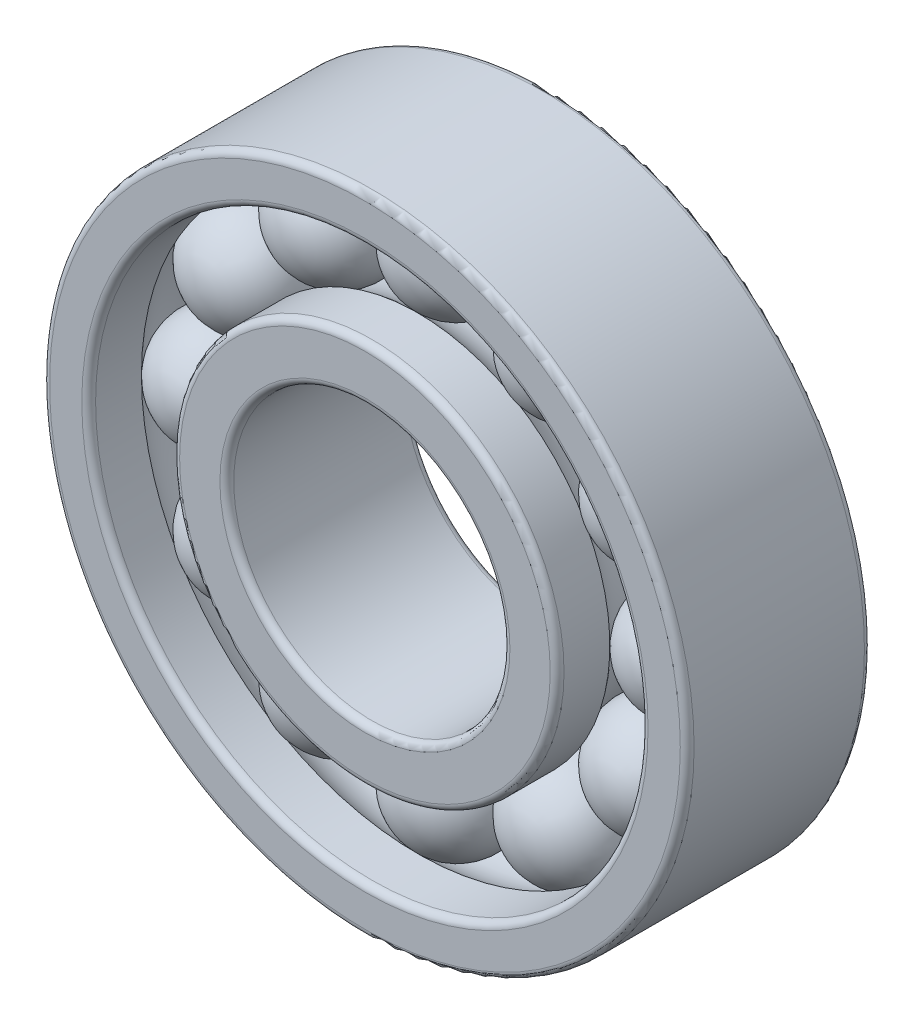
ISO-10303-21;
HEADER;
FILE_DESCRIPTION(('STEP AP214'),'2;1');
FILE_NAME('part.step','',(''),(''),'','','');
FILE_SCHEMA(('AUTOMOTIVE_DESIGN { 1 0 10303 214 1 1 1 1 }'));
ENDSEC;
DATA;
#1=APPLICATION_CONTEXT('core data for automotive mechanical design processes');
#2=APPLICATION_PROTOCOL_DEFINITION('international standard','automotive_design',2000,#1);
#3=PRODUCT_CONTEXT('',#1,'mechanical');
#4=PRODUCT('Part','Part','',(#3));
#5=PRODUCT_RELATED_PRODUCT_CATEGORY('part','',(#4));
#6=PRODUCT_DEFINITION_FORMATION('','',#4);
#7=PRODUCT_DEFINITION_CONTEXT('part definition',#1,'design');
#8=PRODUCT_DEFINITION('design','',#6,#7);
#9=PRODUCT_DEFINITION_SHAPE('','',#8);
#10=(LENGTH_UNIT() NAMED_UNIT(*) SI_UNIT(.MILLI.,.METRE.));
#11=(NAMED_UNIT(*) PLANE_ANGLE_UNIT() SI_UNIT($,.RADIAN.));
#12=(NAMED_UNIT(*) SI_UNIT($,.STERADIAN.) SOLID_ANGLE_UNIT());
#13=UNCERTAINTY_MEASURE_WITH_UNIT(LENGTH_MEASURE(1.E-05),#10,'distance_accuracy_value','');
#14=(GEOMETRIC_REPRESENTATION_CONTEXT(3) GLOBAL_UNCERTAINTY_ASSIGNED_CONTEXT((#13)) GLOBAL_UNIT_ASSIGNED_CONTEXT((#10,
#11,#12)) REPRESENTATION_CONTEXT('',''));
#15=CARTESIAN_POINT('',(0.,0.,0.));
#16=DIRECTION('',(0.,0.,1.));
#17=DIRECTION('',(1.,0.,0.));
#18=AXIS2_PLACEMENT_3D('',#15,#16,#17);
#19=CARTESIAN_POINT('',(-8.81180848350673,5.08749999999989,4.));
#20=DIRECTION('',(0.,0.,-1.));
#21=DIRECTION('',(0.866025403784445,-0.499999999999989,0.));
#22=AXIS2_PLACEMENT_3D('',#19,#20,#21);
#23=SPHERICAL_SURFACE('',#22,2.5);
#24=CARTESIAN_POINT('',(-8.81180848350673,5.08749999999989,1.5));
#25=VERTEX_POINT('',#24);
#26=VERTEX_LOOP('',#25);
#27=FACE_BOUND('',#26,.T.);
#28=ADVANCED_FACE('F73',(#27),#23,.T.);
#29=CLOSED_SHELL('',(#28));
#30=MANIFOLD_SOLID_BREP('B2',#29);
#31=CARTESIAN_POINT('',(-5.0875000000001,8.8118084835066,4.));
#32=DIRECTION('',(0.,0.,-1.));
#33=DIRECTION('',(0.50000000000001,-0.866025403784433,0.));
#34=AXIS2_PLACEMENT_3D('',#31,#32,#33);
#35=SPHERICAL_SURFACE('',#34,2.5);
#36=CARTESIAN_POINT('',(-5.0875000000001,8.8118084835066,1.5));
#37=VERTEX_POINT('',#36);
#38=VERTEX_LOOP('',#37);
#39=FACE_BOUND('',#38,.T.);
#40=ADVANCED_FACE('F91',(#39),#35,.T.);
#41=CLOSED_SHELL('',(#40));
#42=MANIFOLD_SOLID_BREP('B7',#41);
#43=CARTESIAN_POINT('',(-1.06577529597864E-13,10.175,4.));
#44=DIRECTION('',(0.,0.,-1.));
#45=DIRECTION('',(0.,-1.,0.));
#46=AXIS2_PLACEMENT_3D('',#43,#44,#45);
#47=SPHERICAL_SURFACE('',#46,2.5);
#48=CARTESIAN_POINT('',(-1.06577529597864E-13,10.175,1.5));
#49=VERTEX_POINT('',#48);
#50=VERTEX_LOOP('',#49);
#51=FACE_BOUND('',#50,.T.);
#52=ADVANCED_FACE('F109',(#51),#47,.T.);
#53=CLOSED_SHELL('',(#52));
#54=MANIFOLD_SOLID_BREP('B69',#53);
#55=CARTESIAN_POINT('',(5.08749999999992,8.81180848350671,4.));
#56=DIRECTION('',(0.,0.,-1.));
#57=DIRECTION('',(-0.499999999999992,-0.866025403784443,0.));
#58=AXIS2_PLACEMENT_3D('',#55,#56,#57);
#59=SPHERICAL_SURFACE('',#58,2.5);
#60=CARTESIAN_POINT('',(5.08749999999992,8.81180848350671,1.5));
#61=VERTEX_POINT('',#60);
#62=VERTEX_LOOP('',#61);
#63=FACE_BOUND('',#62,.T.);
#64=ADVANCED_FACE('F127',(#63),#59,.T.);
#65=CLOSED_SHELL('',(#64));
#66=MANIFOLD_SOLID_BREP('B87',#65);
#67=CARTESIAN_POINT('',(8.81180848350662,5.08750000000007,4.));
#68=DIRECTION('',(0.,0.,-1.));
#69=DIRECTION('',(-0.866025403784435,-0.500000000000007,0.));
#70=AXIS2_PLACEMENT_3D('',#67,#68,#69);
#71=SPHERICAL_SURFACE('',#70,2.5);
#72=CARTESIAN_POINT('',(8.81180848350662,5.08750000000007,1.5));
#73=VERTEX_POINT('',#72);
#74=VERTEX_LOOP('',#73);
#75=FACE_BOUND('',#74,.T.);
#76=ADVANCED_FACE('F145',(#75),#71,.T.);
#77=CLOSED_SHELL('',(#76));
#78=MANIFOLD_SOLID_BREP('B105',#77);
#79=CARTESIAN_POINT('',(10.175,0.,4.));
#80=DIRECTION('',(0.,0.,-1.));
#81=DIRECTION('',(-1.,0.,0.));
#82=AXIS2_PLACEMENT_3D('',#79,#80,#81);
#83=SPHERICAL_SURFACE('',#82,2.5);
#84=CARTESIAN_POINT('',(10.175,0.,1.5));
#85=VERTEX_POINT('',#84);
#86=VERTEX_LOOP('',#85);
#87=FACE_BOUND('',#86,.T.);
#88=ADVANCED_FACE('F163',(#87),#83,.T.);
#89=CLOSED_SHELL('',(#88));
#90=MANIFOLD_SOLID_BREP('B123',#89);
#91=CARTESIAN_POINT('',(8.81180848350669,-5.08749999999995,4.));
#92=DIRECTION('',(0.,0.,-1.));
#93=DIRECTION('',(-0.866025403784442,0.499999999999995,0.));
#94=AXIS2_PLACEMENT_3D('',#91,#92,#93);
#95=SPHERICAL_SURFACE('',#94,2.5);
#96=CARTESIAN_POINT('',(8.81180848350669,-5.08749999999995,1.5));
#97=VERTEX_POINT('',#96);
#98=VERTEX_LOOP('',#97);
#99=FACE_BOUND('',#98,.T.);
#100=ADVANCED_FACE('F181',(#99),#95,.T.);
#101=CLOSED_SHELL('',(#100));
#102=MANIFOLD_SOLID_BREP('B141',#101);
#103=CARTESIAN_POINT('',(5.08750000000004,-8.81180848350664,4.));
#104=DIRECTION('',(0.,0.,-1.));
#105=DIRECTION('',(-0.500000000000004,0.866025403784436,0.));
#106=AXIS2_PLACEMENT_3D('',#103,#104,#105);
#107=SPHERICAL_SURFACE('',#106,2.5);
#108=CARTESIAN_POINT('',(5.08750000000004,-8.81180848350664,1.5));
#109=VERTEX_POINT('',#108);
#110=VERTEX_LOOP('',#109);
#111=FACE_BOUND('',#110,.T.);
#112=ADVANCED_FACE('F199',(#111),#107,.T.);
#113=CLOSED_SHELL('',(#112));
#114=MANIFOLD_SOLID_BREP('B159',#113);
#115=CARTESIAN_POINT('',(0.,-10.175,4.));
#116=DIRECTION('',(0.,0.,-1.));
#117=DIRECTION('',(0.,1.,0.));
#118=AXIS2_PLACEMENT_3D('',#115,#116,#117);
#119=SPHERICAL_SURFACE('',#118,2.5);
#120=CARTESIAN_POINT('',(0.,-10.175,1.5));
#121=VERTEX_POINT('',#120);
#122=VERTEX_LOOP('',#121);
#123=FACE_BOUND('',#122,.T.);
#124=ADVANCED_FACE('F217',(#123),#119,.T.);
#125=CLOSED_SHELL('',(#124));
#126=MANIFOLD_SOLID_BREP('B177',#125);
#127=CARTESIAN_POINT('',(-5.08749999999998,-8.81180848350667,4.));
#128=DIRECTION('',(0.,0.,-1.));
#129=DIRECTION('',(0.499999999999998,0.86602540378444,0.));
#130=AXIS2_PLACEMENT_3D('',#127,#128,#129);
#131=SPHERICAL_SURFACE('',#130,2.5);
#132=CARTESIAN_POINT('',(-5.08749999999998,-8.81180848350667,1.5));
#133=VERTEX_POINT('',#132);
#134=VERTEX_LOOP('',#133);
#135=FACE_BOUND('',#134,.T.);
#136=ADVANCED_FACE('F235',(#135),#131,.T.);
#137=CLOSED_SHELL('',(#136));
#138=MANIFOLD_SOLID_BREP('B195',#137);
#139=CARTESIAN_POINT('',(-8.81180848350666,-5.08750000000001,4.));
#140=DIRECTION('',(0.,0.,-1.));
#141=DIRECTION('',(0.866025403784438,0.500000000000001,0.));
#142=AXIS2_PLACEMENT_3D('',#139,#140,#141);
#143=SPHERICAL_SURFACE('',#142,2.5);
#144=CARTESIAN_POINT('',(-8.81180848350666,-5.08750000000001,1.5));
#145=VERTEX_POINT('',#144);
#146=VERTEX_LOOP('',#145);
#147=FACE_BOUND('',#146,.T.);
#148=ADVANCED_FACE('F253',(#147),#143,.T.);
#149=CLOSED_SHELL('',(#148));
#150=MANIFOLD_SOLID_BREP('B213',#149);
#151=CARTESIAN_POINT('',(-10.175,0.,4.));
#152=DIRECTION('',(0.,0.,-1.));
#153=DIRECTION('',(1.,0.,0.));
#154=AXIS2_PLACEMENT_3D('',#151,#152,#153);
#155=SPHERICAL_SURFACE('',#154,2.5);
#156=CARTESIAN_POINT('',(-10.175,0.,1.5));
#157=VERTEX_POINT('',#156);
#158=VERTEX_LOOP('',#157);
#159=FACE_BOUND('',#158,.T.);
#160=ADVANCED_FACE('F273',(#159),#155,.T.);
#161=CLOSED_SHELL('',(#160));
#162=MANIFOLD_SOLID_BREP('B231',#161);
#163=CARTESIAN_POINT('',(0.,0.,8.));
#164=DIRECTION('',(0.,0.,-1.));
#165=DIRECTION('',(-1.,0.,0.));
#166=AXIS2_PLACEMENT_3D('',#163,#164,#165);
#167=CYLINDRICAL_SURFACE('',#166,8.35);
#168=CARTESIAN_POINT('',(0.,0.,0.3));
#169=DIRECTION('',(0.,0.,1.));
#170=DIRECTION('',(1.,0.,0.));
#171=AXIS2_PLACEMENT_3D('',#168,#169,#170);
#172=CIRCLE('',#171,8.35);
#173=CARTESIAN_POINT('',(8.35,0.,0.3));
#174=VERTEX_POINT('',#173);
#175=EDGE_CURVE('E272',#174,#174,#172,.T.);
#176=ORIENTED_EDGE('',*,*,#175,.T.);
#177=EDGE_LOOP('',(#176));
#178=FACE_BOUND('',#177,.T.);
#179=CARTESIAN_POINT('',(0.,0.,2.29138213751582));
#180=DIRECTION('',(0.,0.,1.));
#181=DIRECTION('',(1.,0.,0.));
#182=AXIS2_PLACEMENT_3D('',#179,#180,#181);
#183=CIRCLE('',#182,8.35);
#184=CARTESIAN_POINT('',(8.35,0.,2.29138213751582));
#185=VERTEX_POINT('',#184);
#186=EDGE_CURVE('E324',#185,#185,#183,.F.);
#187=ORIENTED_EDGE('',*,*,#186,.T.);
#188=EDGE_LOOP('',(#187));
#189=FACE_BOUND('',#188,.T.);
#190=ADVANCED_FACE('F292',(#178,#189),#167,.T.);
#191=CARTESIAN_POINT('',(0.,0.,8.));
#192=DIRECTION('',(0.,0.,1.));
#193=DIRECTION('',(1.,0.,0.));
#194=AXIS2_PLACEMENT_3D('',#191,#192,#193);
#195=PLANE('',#194);
#196=CARTESIAN_POINT('',(0.,0.,8.));
#197=DIRECTION('',(0.,0.,1.));
#198=DIRECTION('',(1.,0.,0.));
#199=AXIS2_PLACEMENT_3D('',#196,#197,#198);
#200=CIRCLE('',#199,6.3);
#201=CARTESIAN_POINT('',(6.3,0.,8.));
#202=VERTEX_POINT('',#201);
#203=EDGE_CURVE('E312',#202,#202,#200,.F.);
#204=ORIENTED_EDGE('',*,*,#203,.T.);
#205=EDGE_LOOP('',(#204));
#206=FACE_BOUND('',#205,.T.);
#207=CARTESIAN_POINT('',(0.,0.,8.));
#208=DIRECTION('',(0.,0.,1.));
#209=DIRECTION('',(1.,0.,0.));
#210=AXIS2_PLACEMENT_3D('',#207,#208,#209);
#211=CIRCLE('',#210,8.05);
#212=CARTESIAN_POINT('',(8.05,0.,8.));
#213=VERTEX_POINT('',#212);
#214=EDGE_CURVE('E315',#213,#213,#211,.T.);
#215=ORIENTED_EDGE('',*,*,#214,.T.);
#216=EDGE_LOOP('',(#215));
#217=FACE_BOUND('',#216,.T.);
#218=ADVANCED_FACE('F351',(#206,#217),#195,.T.);
#219=CARTESIAN_POINT('',(0.,0.,0.));
#220=DIRECTION('',(0.,0.,1.));
#221=DIRECTION('',(1.,0.,0.));
#222=AXIS2_PLACEMENT_3D('',#219,#220,#221);
#223=PLANE('',#222);
#224=CARTESIAN_POINT('',(0.,0.,0.));
#225=DIRECTION('',(0.,0.,1.));
#226=DIRECTION('',(1.,0.,0.));
#227=AXIS2_PLACEMENT_3D('',#224,#225,#226);
#228=CIRCLE('',#227,6.3);
#229=CARTESIAN_POINT('',(6.3,0.,0.));
#230=VERTEX_POINT('',#229);
#231=EDGE_CURVE('E299',#230,#230,#228,.T.);
#232=ORIENTED_EDGE('',*,*,#231,.T.);
#233=EDGE_LOOP('',(#232));
#234=FACE_BOUND('',#233,.T.);
#235=CARTESIAN_POINT('',(0.,0.,0.));
#236=DIRECTION('',(0.,0.,1.));
#237=DIRECTION('',(1.,0.,0.));
#238=AXIS2_PLACEMENT_3D('',#235,#236,#237);
#239=CIRCLE('',#238,8.05);
#240=CARTESIAN_POINT('',(8.05,0.,0.));
#241=VERTEX_POINT('',#240);
#242=EDGE_CURVE('E303',#241,#241,#239,.F.);
#243=ORIENTED_EDGE('',*,*,#242,.T.);
#244=EDGE_LOOP('',(#243));
#245=FACE_BOUND('',#244,.T.);
#246=ADVANCED_FACE('F355',(#234,#245),#223,.F.);
#247=CARTESIAN_POINT('',(0.,0.,7.7));
#248=DIRECTION('',(0.,0.,1.));
#249=DIRECTION('',(1.,0.,0.));
#250=AXIS2_PLACEMENT_3D('',#247,#248,#249);
#251=CIRCLE('',#250,8.35);
#252=CARTESIAN_POINT('',(8.35,0.,7.7));
#253=VERTEX_POINT('',#252);
#254=EDGE_CURVE('E307',#253,#253,#251,.F.);
#255=ORIENTED_EDGE('',*,*,#254,.T.);
#256=EDGE_LOOP('',(#255));
#257=FACE_BOUND('',#256,.T.);
#258=CARTESIAN_POINT('',(0.,0.,5.70861786248418));
#259=DIRECTION('',(0.,0.,-1.));
#260=DIRECTION('',(-1.,0.,0.));
#261=AXIS2_PLACEMENT_3D('',#258,#259,#260);
#262=CIRCLE('',#261,8.35);
#263=CARTESIAN_POINT('',(-8.35,0.,5.70861786248418));
#264=VERTEX_POINT('',#263);
#265=EDGE_CURVE('E327',#264,#264,#262,.F.);
#266=ORIENTED_EDGE('',*,*,#265,.T.);
#267=EDGE_LOOP('',(#266));
#268=FACE_BOUND('',#267,.T.);
#269=ADVANCED_FACE('F331',(#257,#268),#167,.T.);
#270=CARTESIAN_POINT('',(0.,0.,8.));
#271=DIRECTION('',(0.,0.,-1.));
#272=DIRECTION('',(-1.,0.,0.));
#273=AXIS2_PLACEMENT_3D('',#270,#271,#272);
#274=CYLINDRICAL_SURFACE('',#273,6.);
#275=CARTESIAN_POINT('',(0.,0.,7.7));
#276=DIRECTION('',(0.,0.,1.));
#277=DIRECTION('',(1.,0.,0.));
#278=AXIS2_PLACEMENT_3D('',#275,#276,#277);
#279=CIRCLE('',#278,6.);
#280=CARTESIAN_POINT('',(6.,0.,7.7));
#281=VERTEX_POINT('',#280);
#282=EDGE_CURVE('E318',#281,#281,#279,.T.);
#283=ORIENTED_EDGE('',*,*,#282,.T.);
#284=EDGE_LOOP('',(#283));
#285=FACE_BOUND('',#284,.T.);
#286=CARTESIAN_POINT('',(0.,0.,0.3));
#287=DIRECTION('',(0.,0.,1.));
#288=DIRECTION('',(1.,0.,0.));
#289=AXIS2_PLACEMENT_3D('',#286,#287,#288);
#290=CIRCLE('',#289,6.);
#291=CARTESIAN_POINT('',(6.,0.,0.3));
#292=VERTEX_POINT('',#291);
#293=EDGE_CURVE('E321',#292,#292,#290,.F.);
#294=ORIENTED_EDGE('',*,*,#293,.T.);
#295=EDGE_LOOP('',(#294));
#296=FACE_BOUND('',#295,.T.);
#297=ADVANCED_FACE('F336',(#285,#296),#274,.F.);
#298=CARTESIAN_POINT('',(0.,0.,4.));
#299=DIRECTION('',(0.,0.,-1.));
#300=DIRECTION('',(-1.,0.,0.));
#301=AXIS2_PLACEMENT_3D('',#298,#299,#300);
#302=TOROIDAL_SURFACE('',#301,10.175,2.5);
#303=ORIENTED_EDGE('',*,*,#186,.F.);
#304=EDGE_LOOP('',(#303));
#305=FACE_BOUND('',#304,.T.);
#306=ORIENTED_EDGE('',*,*,#265,.F.);
#307=EDGE_LOOP('',(#306));
#308=FACE_BOUND('',#307,.T.);
#309=ADVANCED_FACE('F333',(#305,#308),#302,.F.);
#310=CARTESIAN_POINT('',(0.,0.,7.7));
#311=DIRECTION('',(0.,0.,1.));
#312=DIRECTION('',(1.,0.,0.));
#313=AXIS2_PLACEMENT_3D('',#310,#311,#312);
#314=TOROIDAL_SURFACE('',#313,6.3,0.3);
#315=ORIENTED_EDGE('',*,*,#203,.F.);
#316=EDGE_LOOP('',(#315));
#317=FACE_BOUND('',#316,.T.);
#318=ORIENTED_EDGE('',*,*,#282,.F.);
#319=EDGE_LOOP('',(#318));
#320=FACE_BOUND('',#319,.T.);
#321=ADVANCED_FACE('F335',(#317,#320),#314,.T.);
#322=CARTESIAN_POINT('',(0.,0.,7.7));
#323=DIRECTION('',(0.,0.,1.));
#324=DIRECTION('',(1.,0.,0.));
#325=AXIS2_PLACEMENT_3D('',#322,#323,#324);
#326=TOROIDAL_SURFACE('',#325,8.05,0.3);
#327=ORIENTED_EDGE('',*,*,#254,.F.);
#328=EDGE_LOOP('',(#327));
#329=FACE_BOUND('',#328,.T.);
#330=ORIENTED_EDGE('',*,*,#214,.F.);
#331=EDGE_LOOP('',(#330));
#332=FACE_BOUND('',#331,.T.);
#333=ADVANCED_FACE('F343',(#329,#332),#326,.T.);
#334=CARTESIAN_POINT('',(0.,0.,0.3));
#335=DIRECTION('',(0.,0.,1.));
#336=DIRECTION('',(1.,0.,0.));
#337=AXIS2_PLACEMENT_3D('',#334,#335,#336);
#338=TOROIDAL_SURFACE('',#337,6.3,0.3);
#339=ORIENTED_EDGE('',*,*,#293,.F.);
#340=EDGE_LOOP('',(#339));
#341=FACE_BOUND('',#340,.T.);
#342=ORIENTED_EDGE('',*,*,#231,.F.);
#343=EDGE_LOOP('',(#342));
#344=FACE_BOUND('',#343,.T.);
#345=ADVANCED_FACE('F369',(#341,#344),#338,.T.);
#346=CARTESIAN_POINT('',(0.,0.,0.3));
#347=DIRECTION('',(0.,0.,1.));
#348=DIRECTION('',(1.,0.,0.));
#349=AXIS2_PLACEMENT_3D('',#346,#347,#348);
#350=TOROIDAL_SURFACE('',#349,8.05,0.3);
#351=ORIENTED_EDGE('',*,*,#242,.F.);
#352=EDGE_LOOP('',(#351));
#353=FACE_BOUND('',#352,.T.);
#354=ORIENTED_EDGE('',*,*,#175,.F.);
#355=EDGE_LOOP('',(#354));
#356=FACE_BOUND('',#355,.T.);
#357=ADVANCED_FACE('F294',(#353,#356),#350,.T.);
#358=CLOSED_SHELL('',(#190,#218,#246,#269,#297,#309,#321,#333,#345,#357));
#359=MANIFOLD_SOLID_BREP('B249',#358);
#360=CARTESIAN_POINT('',(0.,0.,8.));
#361=DIRECTION('',(0.,0.,-1.));
#362=DIRECTION('',(-1.,0.,0.));
#363=AXIS2_PLACEMENT_3D('',#360,#361,#362);
#364=CYLINDRICAL_SURFACE('',#363,12.);
#365=CARTESIAN_POINT('',(0.,0.,0.3));
#366=DIRECTION('',(0.,0.,1.));
#367=DIRECTION('',(1.,0.,0.));
#368=AXIS2_PLACEMENT_3D('',#365,#366,#367);
#369=CIRCLE('',#368,12.);
#370=CARTESIAN_POINT('',(12.,0.,0.3));
#371=VERTEX_POINT('',#370);
#372=EDGE_CURVE('E465',#371,#371,#369,.F.);
#373=ORIENTED_EDGE('',*,*,#372,.T.);
#374=EDGE_LOOP('',(#373));
#375=FACE_BOUND('',#374,.T.);
#376=CARTESIAN_POINT('',(0.,0.,2.29138213751582));
#377=DIRECTION('',(0.,0.,1.));
#378=DIRECTION('',(1.,0.,0.));
#379=AXIS2_PLACEMENT_3D('',#376,#377,#378);
#380=CIRCLE('',#379,12.);
#381=CARTESIAN_POINT('',(12.,0.,2.29138213751582));
#382=VERTEX_POINT('',#381);
#383=EDGE_CURVE('E474',#382,#382,#380,.F.);
#384=ORIENTED_EDGE('',*,*,#383,.F.);
#385=EDGE_LOOP('',(#384));
#386=FACE_BOUND('',#385,.T.);
#387=ADVANCED_FACE('F442',(#375,#386),#364,.F.);
#388=CARTESIAN_POINT('',(0.,0.,8.));
#389=DIRECTION('',(0.,0.,1.));
#390=DIRECTION('',(1.,0.,0.));
#391=AXIS2_PLACEMENT_3D('',#388,#389,#390);
#392=PLANE('',#391);
#393=CARTESIAN_POINT('',(0.,0.,8.));
#394=DIRECTION('',(0.,0.,1.));
#395=DIRECTION('',(1.,0.,0.));
#396=AXIS2_PLACEMENT_3D('',#393,#394,#395);
#397=CIRCLE('',#396,12.3);
#398=CARTESIAN_POINT('',(12.3,0.,8.));
#399=VERTEX_POINT('',#398);
#400=EDGE_CURVE('E291',#399,#399,#397,.F.);
#401=ORIENTED_EDGE('',*,*,#400,.T.);
#402=EDGE_LOOP('',(#401));
#403=FACE_BOUND('',#402,.T.);
#404=CARTESIAN_POINT('',(0.,0.,8.));
#405=DIRECTION('',(0.,0.,1.));
#406=DIRECTION('',(1.,0.,0.));
#407=AXIS2_PLACEMENT_3D('',#404,#405,#406);
#408=CIRCLE('',#407,13.7);
#409=CARTESIAN_POINT('',(13.7,0.,8.));
#410=VERTEX_POINT('',#409);
#411=EDGE_CURVE('E449',#410,#410,#408,.T.);
#412=ORIENTED_EDGE('',*,*,#411,.T.);
#413=EDGE_LOOP('',(#412));
#414=FACE_BOUND('',#413,.T.);
#415=ADVANCED_FACE('F500',(#403,#414),#392,.T.);
#416=CARTESIAN_POINT('',(0.,0.,0.));
#417=DIRECTION('',(0.,0.,1.));
#418=DIRECTION('',(1.,0.,0.));
#419=AXIS2_PLACEMENT_3D('',#416,#417,#418);
#420=PLANE('',#419);
#421=CARTESIAN_POINT('',(0.,0.,0.));
#422=DIRECTION('',(0.,0.,1.));
#423=DIRECTION('',(1.,0.,0.));
#424=AXIS2_PLACEMENT_3D('',#421,#422,#423);
#425=CIRCLE('',#424,12.3);
#426=CARTESIAN_POINT('',(12.3,0.,0.));
#427=VERTEX_POINT('',#426);
#428=EDGE_CURVE('E468',#427,#427,#425,.T.);
#429=ORIENTED_EDGE('',*,*,#428,.T.);
#430=EDGE_LOOP('',(#429));
#431=FACE_BOUND('',#430,.T.);
#432=CARTESIAN_POINT('',(0.,0.,0.));
#433=DIRECTION('',(0.,0.,1.));
#434=DIRECTION('',(1.,0.,0.));
#435=AXIS2_PLACEMENT_3D('',#432,#433,#434);
#436=CIRCLE('',#435,13.7);
#437=CARTESIAN_POINT('',(13.7,0.,0.));
#438=VERTEX_POINT('',#437);
#439=EDGE_CURVE('E471',#438,#438,#436,.F.);
#440=ORIENTED_EDGE('',*,*,#439,.T.);
#441=EDGE_LOOP('',(#440));
#442=FACE_BOUND('',#441,.T.);
#443=ADVANCED_FACE('F495',(#431,#442),#420,.F.);
#444=CARTESIAN_POINT('',(0.,0.,8.));
#445=DIRECTION('',(0.,0.,-1.));
#446=DIRECTION('',(-1.,0.,0.));
#447=AXIS2_PLACEMENT_3D('',#444,#445,#446);
#448=CYLINDRICAL_SURFACE('',#447,14.);
#449=CARTESIAN_POINT('',(0.,0.,0.3));
#450=DIRECTION('',(0.,0.,1.));
#451=DIRECTION('',(1.,0.,0.));
#452=AXIS2_PLACEMENT_3D('',#449,#450,#451);
#453=CIRCLE('',#452,14.);
#454=CARTESIAN_POINT('',(14.,0.,0.3));
#455=VERTEX_POINT('',#454);
#456=EDGE_CURVE('E457',#455,#455,#453,.T.);
#457=ORIENTED_EDGE('',*,*,#456,.T.);
#458=EDGE_LOOP('',(#457));
#459=FACE_BOUND('',#458,.T.);
#460=CARTESIAN_POINT('',(0.,0.,7.7));
#461=DIRECTION('',(0.,0.,1.));
#462=DIRECTION('',(1.,0.,0.));
#463=AXIS2_PLACEMENT_3D('',#460,#461,#462);
#464=CIRCLE('',#463,14.);
#465=CARTESIAN_POINT('',(14.,0.,7.7));
#466=VERTEX_POINT('',#465);
#467=EDGE_CURVE('E462',#466,#466,#464,.F.);
#468=ORIENTED_EDGE('',*,*,#467,.T.);
#469=EDGE_LOOP('',(#468));
#470=FACE_BOUND('',#469,.T.);
#471=ADVANCED_FACE('F486',(#459,#470),#448,.T.);
#472=CARTESIAN_POINT('',(0.,0.,7.7));
#473=DIRECTION('',(0.,0.,1.));
#474=DIRECTION('',(1.,0.,0.));
#475=AXIS2_PLACEMENT_3D('',#472,#473,#474);
#476=CIRCLE('',#475,12.);
#477=CARTESIAN_POINT('',(12.,0.,7.7));
#478=VERTEX_POINT('',#477);
#479=EDGE_CURVE('E453',#478,#478,#476,.T.);
#480=ORIENTED_EDGE('',*,*,#479,.T.);
#481=EDGE_LOOP('',(#480));
#482=FACE_BOUND('',#481,.T.);
#483=CARTESIAN_POINT('',(0.,0.,5.70861786248418));
#484=DIRECTION('',(0.,0.,-1.));
#485=DIRECTION('',(-1.,0.,0.));
#486=AXIS2_PLACEMENT_3D('',#483,#484,#485);
#487=CIRCLE('',#486,12.);
#488=CARTESIAN_POINT('',(-12.,0.,5.70861786248418));
#489=VERTEX_POINT('',#488);
#490=EDGE_CURVE('E477',#489,#489,#487,.F.);
#491=ORIENTED_EDGE('',*,*,#490,.F.);
#492=EDGE_LOOP('',(#491));
#493=FACE_BOUND('',#492,.T.);
#494=ADVANCED_FACE('F484',(#482,#493),#364,.F.);
#495=CARTESIAN_POINT('',(0.,0.,4.));
#496=DIRECTION('',(0.,0.,-1.));
#497=DIRECTION('',(-1.,0.,0.));
#498=AXIS2_PLACEMENT_3D('',#495,#496,#497);
#499=TOROIDAL_SURFACE('',#498,10.175,2.5);
#500=ORIENTED_EDGE('',*,*,#490,.T.);
#501=EDGE_LOOP('',(#500));
#502=FACE_BOUND('',#501,.T.);
#503=ORIENTED_EDGE('',*,*,#383,.T.);
#504=EDGE_LOOP('',(#503));
#505=FACE_BOUND('',#504,.T.);
#506=ADVANCED_FACE('F481',(#502,#505),#499,.F.);
#507=CARTESIAN_POINT('',(0.,0.,0.3));
#508=DIRECTION('',(0.,0.,1.));
#509=DIRECTION('',(1.,0.,0.));
#510=AXIS2_PLACEMENT_3D('',#507,#508,#509);
#511=TOROIDAL_SURFACE('',#510,12.3,0.3);
#512=ORIENTED_EDGE('',*,*,#372,.F.);
#513=EDGE_LOOP('',(#512));
#514=FACE_BOUND('',#513,.T.);
#515=ORIENTED_EDGE('',*,*,#428,.F.);
#516=EDGE_LOOP('',(#515));
#517=FACE_BOUND('',#516,.T.);
#518=ADVANCED_FACE('F493',(#514,#517),#511,.T.);
#519=CARTESIAN_POINT('',(0.,0.,0.3));
#520=DIRECTION('',(0.,0.,1.));
#521=DIRECTION('',(1.,0.,0.));
#522=AXIS2_PLACEMENT_3D('',#519,#520,#521);
#523=TOROIDAL_SURFACE('',#522,13.7,0.3);
#524=ORIENTED_EDGE('',*,*,#439,.F.);
#525=EDGE_LOOP('',(#524));
#526=FACE_BOUND('',#525,.T.);
#527=ORIENTED_EDGE('',*,*,#456,.F.);
#528=EDGE_LOOP('',(#527));
#529=FACE_BOUND('',#528,.T.);
#530=ADVANCED_FACE('F511',(#526,#529),#523,.T.);
#531=CARTESIAN_POINT('',(0.,0.,7.7));
#532=DIRECTION('',(0.,0.,1.));
#533=DIRECTION('',(1.,0.,0.));
#534=AXIS2_PLACEMENT_3D('',#531,#532,#533);
#535=TOROIDAL_SURFACE('',#534,12.3,0.3);
#536=ORIENTED_EDGE('',*,*,#400,.F.);
#537=EDGE_LOOP('',(#536));
#538=FACE_BOUND('',#537,.T.);
#539=ORIENTED_EDGE('',*,*,#479,.F.);
#540=EDGE_LOOP('',(#539));
#541=FACE_BOUND('',#540,.T.);
#542=ADVANCED_FACE('F522',(#538,#541),#535,.T.);
#543=CARTESIAN_POINT('',(0.,0.,7.7));
#544=DIRECTION('',(0.,0.,1.));
#545=DIRECTION('',(1.,0.,0.));
#546=AXIS2_PLACEMENT_3D('',#543,#544,#545);
#547=TOROIDAL_SURFACE('',#546,13.7,0.3);
#548=ORIENTED_EDGE('',*,*,#467,.F.);
#549=EDGE_LOOP('',(#548));
#550=FACE_BOUND('',#549,.T.);
#551=ORIENTED_EDGE('',*,*,#411,.F.);
#552=EDGE_LOOP('',(#551));
#553=FACE_BOUND('',#552,.T.);
#554=ADVANCED_FACE('F444',(#550,#553),#547,.T.);
#555=CLOSED_SHELL('',(#387,#415,#443,#471,#494,#506,#518,#530,#542,#554));
#556=MANIFOLD_SOLID_BREP('B267',#555);
#557=ADVANCED_BREP_SHAPE_REPRESENTATION('',(#18,#30,#42,#54,#66,#78,#90,#102,#114,#126,#138,
#150,#162,#359,#556),#14);
#558=SHAPE_DEFINITION_REPRESENTATION(#9,#557);
ENDSEC;
END-ISO-10303-21;
